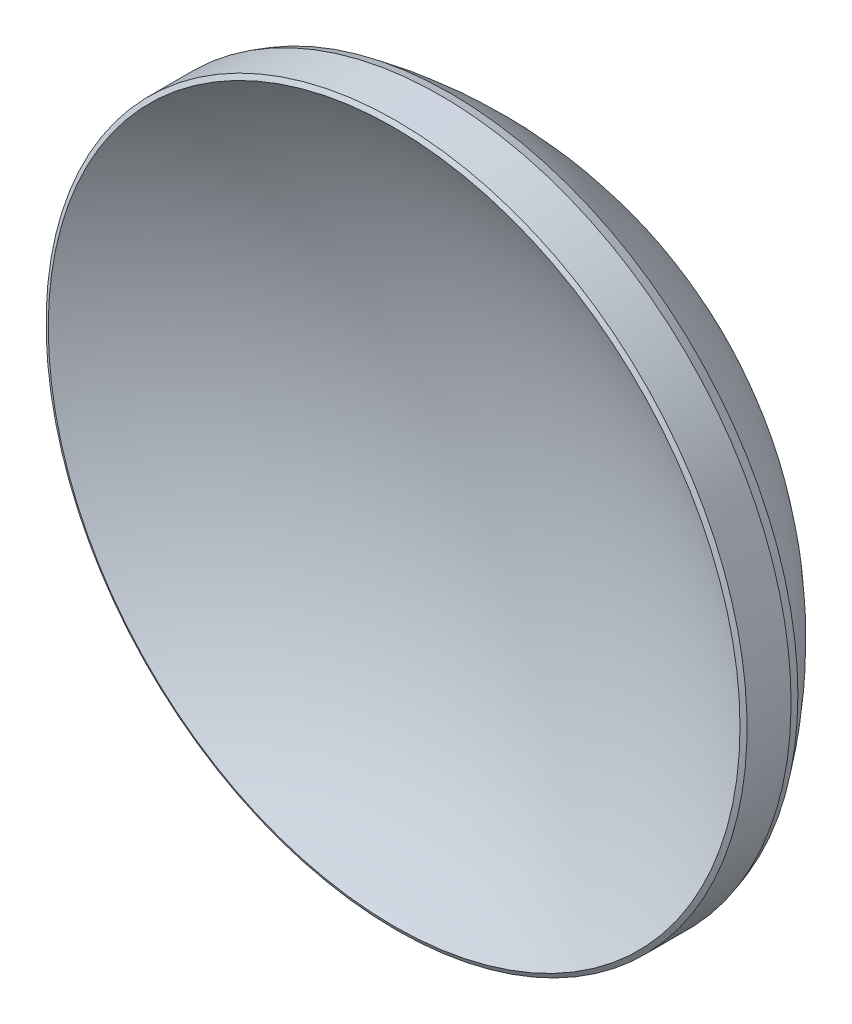
ISO-10303-21;
HEADER;
FILE_DESCRIPTION(('STEP AP214'),'2;1');
FILE_NAME('part.step','',(''),(''),'','','');
FILE_SCHEMA(('AUTOMOTIVE_DESIGN { 1 0 10303 214 1 1 1 1 }'));
ENDSEC;
DATA;
#1=APPLICATION_CONTEXT('core data for automotive mechanical design processes');
#2=APPLICATION_PROTOCOL_DEFINITION('international standard','automotive_design',2000,#1);
#3=PRODUCT_CONTEXT('',#1,'mechanical');
#4=PRODUCT('Part','Part','',(#3));
#5=PRODUCT_RELATED_PRODUCT_CATEGORY('part','',(#4));
#6=PRODUCT_DEFINITION_FORMATION('','',#4);
#7=PRODUCT_DEFINITION_CONTEXT('part definition',#1,'design');
#8=PRODUCT_DEFINITION('design','',#6,#7);
#9=PRODUCT_DEFINITION_SHAPE('','',#8);
#10=(LENGTH_UNIT() NAMED_UNIT(*) SI_UNIT(.MILLI.,.METRE.));
#11=(NAMED_UNIT(*) PLANE_ANGLE_UNIT() SI_UNIT($,.RADIAN.));
#12=(NAMED_UNIT(*) SI_UNIT($,.STERADIAN.) SOLID_ANGLE_UNIT());
#13=UNCERTAINTY_MEASURE_WITH_UNIT(LENGTH_MEASURE(1.E-05),#10,'distance_accuracy_value','');
#14=(GEOMETRIC_REPRESENTATION_CONTEXT(3) GLOBAL_UNCERTAINTY_ASSIGNED_CONTEXT((#13)) GLOBAL_UNIT_ASSIGNED_CONTEXT((#10,
#11,#12)) REPRESENTATION_CONTEXT('',''));
#15=CARTESIAN_POINT('',(0.,0.,0.));
#16=DIRECTION('',(0.,0.,1.));
#17=DIRECTION('',(1.,0.,0.));
#18=AXIS2_PLACEMENT_3D('',#15,#16,#17);
#19=CARTESIAN_POINT('',(0.,0.,24.926));
#20=DIRECTION('',(0.,0.,1.));
#21=DIRECTION('',(0.,1.,0.));
#22=AXIS2_PLACEMENT_3D('',#19,#20,#21);
#23=SPHERICAL_SURFACE('',#22,22.576);
#24=CARTESIAN_POINT('',(0.,0.,6.14886697819466));
#25=DIRECTION('',(0.,0.,1.));
#26=DIRECTION('',(0.,-1.,0.));
#27=AXIS2_PLACEMENT_3D('',#24,#25,#26);
#28=CIRCLE('',#27,12.5337564792614);
#29=CARTESIAN_POINT('',(0.,-12.5337564792614,6.14886697819466));
#30=VERTEX_POINT('',#29);
#31=EDGE_CURVE('E9',#30,#30,#28,.T.);
#32=ORIENTED_EDGE('',*,*,#31,.T.);
#33=EDGE_LOOP('',(#32));
#34=FACE_BOUND('',#33,.T.);
#35=ADVANCED_FACE('F13',(#34),#23,.F.);
#36=CARTESIAN_POINT('',(0.,0.,13.15));
#37=DIRECTION('',(0.,0.,1.));
#38=DIRECTION('',(0.,-1.,0.));
#39=AXIS2_PLACEMENT_3D('',#36,#37,#38);
#40=SPHERICAL_SURFACE('',#39,15.5);
#41=CARTESIAN_POINT('',(0.,0.,4.10412056897272));
#42=DIRECTION('',(0.,0.,1.));
#43=DIRECTION('',(0.,-1.,0.));
#44=AXIS2_PLACEMENT_3D('',#41,#42,#43);
#45=CIRCLE('',#44,12.5865827498697);
#46=CARTESIAN_POINT('',(0.,-12.5865827498697,4.10412056897272));
#47=VERTEX_POINT('',#46);
#48=EDGE_CURVE('E20',#47,#47,#45,.F.);
#49=ORIENTED_EDGE('',*,*,#48,.T.);
#50=EDGE_LOOP('',(#49));
#51=FACE_BOUND('',#50,.T.);
#52=ADVANCED_FACE('F45',(#51),#40,.T.);
#53=CARTESIAN_POINT('',(0.,0.,2.35));
#54=DIRECTION('',(0.,0.,1.));
#55=DIRECTION('',(0.,-1.,0.));
#56=AXIS2_PLACEMENT_3D('',#53,#54,#55);
#57=CYLINDRICAL_SURFACE('',#56,12.7);
#58=CARTESIAN_POINT('',(0.,0.,4.46405604339078));
#59=DIRECTION('',(0.,0.,1.));
#60=DIRECTION('',(0.,-1.,0.));
#61=AXIS2_PLACEMENT_3D('',#58,#59,#60);
#62=CIRCLE('',#61,12.7);
#63=CARTESIAN_POINT('',(0.,-12.7,4.46405604339078));
#64=VERTEX_POINT('',#63);
#65=EDGE_CURVE('E24',#64,#64,#62,.T.);
#66=ORIENTED_EDGE('',*,*,#65,.T.);
#67=EDGE_LOOP('',(#66));
#68=FACE_BOUND('',#67,.T.);
#69=CARTESIAN_POINT('',(0.,0.,6.06090487567771));
#70=DIRECTION('',(0.,0.,-1.));
#71=DIRECTION('',(0.,1.,0.));
#72=AXIS2_PLACEMENT_3D('',#69,#70,#71);
#73=CIRCLE('',#72,12.7);
#74=CARTESIAN_POINT('',(0.,12.7,6.06090487567771));
#75=VERTEX_POINT('',#74);
#76=EDGE_CURVE('E28',#75,#75,#73,.T.);
#77=ORIENTED_EDGE('',*,*,#76,.T.);
#78=EDGE_LOOP('',(#77));
#79=FACE_BOUND('',#78,.T.);
#80=ADVANCED_FACE('F34',(#68,#79),#57,.T.);
#81=CARTESIAN_POINT('',(0.,0.,4.46405604339078));
#82=DIRECTION('',(0.,0.,1.));
#83=DIRECTION('',(0.,-1.,0.));
#84=AXIS2_PLACEMENT_3D('',#81,#82,#83);
#85=CONICAL_SURFACE('',#84,12.7,0.305255793799692);
#86=ORIENTED_EDGE('',*,*,#48,.F.);
#87=EDGE_LOOP('',(#86));
#88=FACE_BOUND('',#87,.T.);
#89=ORIENTED_EDGE('',*,*,#65,.F.);
#90=EDGE_LOOP('',(#89));
#91=FACE_BOUND('',#90,.T.);
#92=ADVANCED_FACE('F38',(#88,#91),#85,.T.);
#93=CARTESIAN_POINT('',(0.,0.,6.14886697819466));
#94=DIRECTION('',(0.,0.,-1.));
#95=DIRECTION('',(0.,1.,0.));
#96=AXIS2_PLACEMENT_3D('',#93,#94,#95);
#97=CONICAL_SURFACE('',#96,12.5337564792614,1.08412815920144);
#98=ORIENTED_EDGE('',*,*,#76,.F.);
#99=EDGE_LOOP('',(#98));
#100=FACE_BOUND('',#99,.T.);
#101=ORIENTED_EDGE('',*,*,#31,.F.);
#102=EDGE_LOOP('',(#101));
#103=FACE_BOUND('',#102,.T.);
#104=ADVANCED_FACE('F15',(#100,#103),#97,.T.);
#105=CLOSED_SHELL('',(#35,#52,#80,#92,#104));
#106=MANIFOLD_SOLID_BREP('B1',#105);
#107=ADVANCED_BREP_SHAPE_REPRESENTATION('',(#18,#106),#14);
#108=SHAPE_DEFINITION_REPRESENTATION(#9,#107);
ENDSEC;
END-ISO-10303-21;
